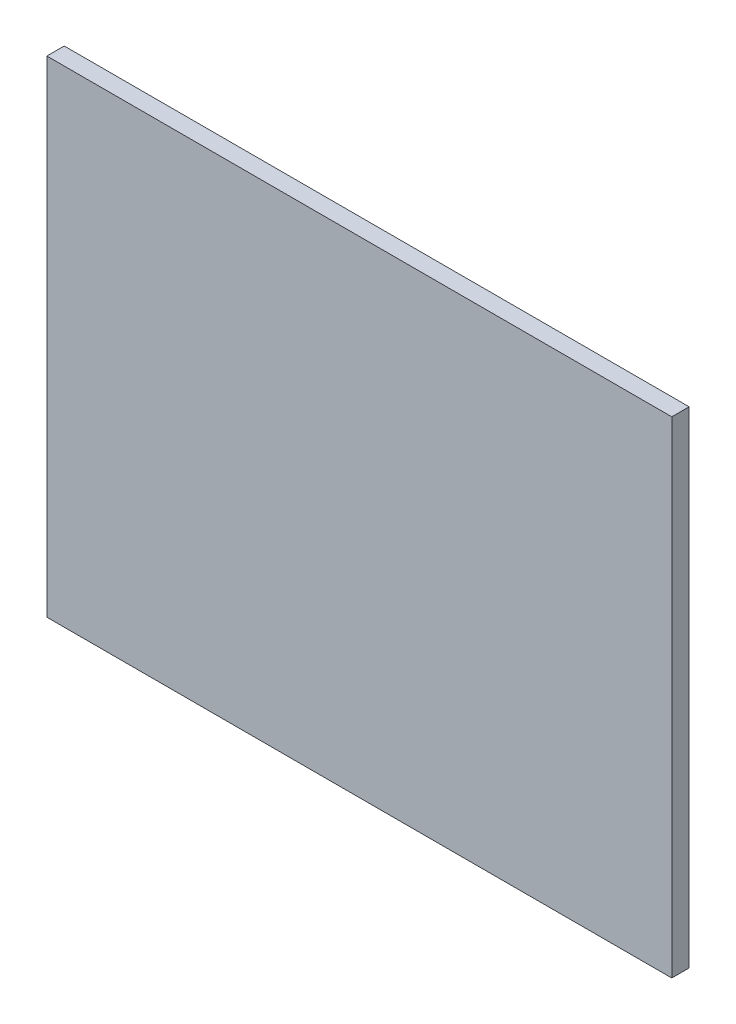
ISO-10303-21;
HEADER;
FILE_DESCRIPTION(('STEP AP214'),'2;1');
FILE_NAME('part.step','',(''),(''),'','','');
FILE_SCHEMA(('AUTOMOTIVE_DESIGN { 1 0 10303 214 1 1 1 1 }'));
ENDSEC;
DATA;
#1=APPLICATION_CONTEXT('core data for automotive mechanical design processes');
#2=APPLICATION_PROTOCOL_DEFINITION('international standard','automotive_design',2000,#1);
#3=PRODUCT_CONTEXT('',#1,'mechanical');
#4=PRODUCT('Part','Part','',(#3));
#5=PRODUCT_RELATED_PRODUCT_CATEGORY('part','',(#4));
#6=PRODUCT_DEFINITION_FORMATION('','',#4);
#7=PRODUCT_DEFINITION_CONTEXT('part definition',#1,'design');
#8=PRODUCT_DEFINITION('design','',#6,#7);
#9=PRODUCT_DEFINITION_SHAPE('','',#8);
#10=(LENGTH_UNIT() NAMED_UNIT(*) SI_UNIT(.MILLI.,.METRE.));
#11=(NAMED_UNIT(*) PLANE_ANGLE_UNIT() SI_UNIT($,.RADIAN.));
#12=(NAMED_UNIT(*) SI_UNIT($,.STERADIAN.) SOLID_ANGLE_UNIT());
#13=UNCERTAINTY_MEASURE_WITH_UNIT(LENGTH_MEASURE(1.E-05),#10,'distance_accuracy_value','');
#14=(GEOMETRIC_REPRESENTATION_CONTEXT(3) GLOBAL_UNCERTAINTY_ASSIGNED_CONTEXT((#13)) GLOBAL_UNIT_ASSIGNED_CONTEXT((#10,
#11,#12)) REPRESENTATION_CONTEXT('',''));
#15=CARTESIAN_POINT('',(0.,0.,0.));
#16=DIRECTION('',(0.,0.,1.));
#17=DIRECTION('',(1.,0.,0.));
#18=AXIS2_PLACEMENT_3D('',#15,#16,#17);
#19=CARTESIAN_POINT('',(-90.,70.,5.));
#20=DIRECTION('',(1.,0.,0.));
#21=DIRECTION('',(0.,1.,0.));
#22=AXIS2_PLACEMENT_3D('',#19,#20,#21);
#23=PLANE('',#22);
#24=DIRECTION('',(0.,-1.,0.));
#25=VECTOR('',#24,1.);
#26=CARTESIAN_POINT('',(-90.,70.,0.));
#27=LINE('',#26,#25);
#28=CARTESIAN_POINT('',(-90.,70.,0.));
#29=VERTEX_POINT('',#28);
#30=CARTESIAN_POINT('',(-90.,-70.,0.));
#31=VERTEX_POINT('',#30);
#32=EDGE_CURVE('E96',#29,#31,#27,.T.);
#33=ORIENTED_EDGE('',*,*,#32,.T.);
#34=DIRECTION('',(0.,0.,-1.));
#35=VECTOR('',#34,1.);
#36=CARTESIAN_POINT('',(-90.,-70.,5.));
#37=LINE('',#36,#35);
#38=CARTESIAN_POINT('',(-90.,-70.,5.));
#39=VERTEX_POINT('',#38);
#40=EDGE_CURVE('E11',#39,#31,#37,.T.);
#41=ORIENTED_EDGE('',*,*,#40,.F.);
#42=DIRECTION('',(0.,-1.,0.));
#43=VECTOR('',#42,1.);
#44=CARTESIAN_POINT('',(-90.,70.,5.));
#45=LINE('',#44,#43);
#46=CARTESIAN_POINT('',(-90.,70.,5.));
#47=VERTEX_POINT('',#46);
#48=EDGE_CURVE('E84',#47,#39,#45,.T.);
#49=ORIENTED_EDGE('',*,*,#48,.F.);
#50=DIRECTION('',(0.,0.,-1.));
#51=VECTOR('',#50,1.);
#52=CARTESIAN_POINT('',(-90.,70.,5.));
#53=LINE('',#52,#51);
#54=EDGE_CURVE('E92',#47,#29,#53,.T.);
#55=ORIENTED_EDGE('',*,*,#54,.T.);
#56=EDGE_LOOP('',(#33,#41,#49,#55));
#57=FACE_BOUND('',#56,.T.);
#58=ADVANCED_FACE('F33',(#57),#23,.F.);
#59=CARTESIAN_POINT('',(-90.,-70.,5.));
#60=DIRECTION('',(0.,1.,0.));
#61=DIRECTION('',(-1.,0.,0.));
#62=AXIS2_PLACEMENT_3D('',#59,#60,#61);
#63=PLANE('',#62);
#64=DIRECTION('',(1.,0.,0.));
#65=VECTOR('',#64,1.);
#66=CARTESIAN_POINT('',(-90.,-70.,0.));
#67=LINE('',#66,#65);
#68=CARTESIAN_POINT('',(90.,-70.,0.));
#69=VERTEX_POINT('',#68);
#70=EDGE_CURVE('E88',#31,#69,#67,.T.);
#71=ORIENTED_EDGE('',*,*,#70,.T.);
#72=DIRECTION('',(0.,0.,-1.));
#73=VECTOR('',#72,1.);
#74=CARTESIAN_POINT('',(90.,-70.,5.));
#75=LINE('',#74,#73);
#76=CARTESIAN_POINT('',(90.,-70.,5.));
#77=VERTEX_POINT('',#76);
#78=EDGE_CURVE('E41',#77,#69,#75,.T.);
#79=ORIENTED_EDGE('',*,*,#78,.F.);
#80=DIRECTION('',(1.,0.,0.));
#81=VECTOR('',#80,1.);
#82=CARTESIAN_POINT('',(-90.,-70.,5.));
#83=LINE('',#82,#81);
#84=EDGE_CURVE('E79',#39,#77,#83,.T.);
#85=ORIENTED_EDGE('',*,*,#84,.F.);
#86=ORIENTED_EDGE('',*,*,#40,.T.);
#87=EDGE_LOOP('',(#71,#79,#85,#86));
#88=FACE_BOUND('',#87,.T.);
#89=ADVANCED_FACE('F87',(#88),#63,.F.);
#90=CARTESIAN_POINT('',(90.,70.,5.));
#91=DIRECTION('',(-1.,0.,0.));
#92=DIRECTION('',(0.,-1.,0.));
#93=AXIS2_PLACEMENT_3D('',#90,#91,#92);
#94=PLANE('',#93);
#95=DIRECTION('',(0.,1.,0.));
#96=VECTOR('',#95,1.);
#97=CARTESIAN_POINT('',(90.,70.,0.));
#98=LINE('',#97,#96);
#99=CARTESIAN_POINT('',(90.,70.,0.));
#100=VERTEX_POINT('',#99);
#101=EDGE_CURVE('E66',#69,#100,#98,.T.);
#102=ORIENTED_EDGE('',*,*,#101,.T.);
#103=DIRECTION('',(0.,0.,-1.));
#104=VECTOR('',#103,1.);
#105=CARTESIAN_POINT('',(90.,70.,5.));
#106=LINE('',#105,#104);
#107=CARTESIAN_POINT('',(90.,70.,5.));
#108=VERTEX_POINT('',#107);
#109=EDGE_CURVE('E89',#108,#100,#106,.T.);
#110=ORIENTED_EDGE('',*,*,#109,.F.);
#111=DIRECTION('',(0.,1.,0.));
#112=VECTOR('',#111,1.);
#113=CARTESIAN_POINT('',(90.,70.,5.));
#114=LINE('',#113,#112);
#115=EDGE_CURVE('E82',#77,#108,#114,.T.);
#116=ORIENTED_EDGE('',*,*,#115,.F.);
#117=ORIENTED_EDGE('',*,*,#78,.T.);
#118=EDGE_LOOP('',(#102,#110,#116,#117));
#119=FACE_BOUND('',#118,.T.);
#120=ADVANCED_FACE('F90',(#119),#94,.F.);
#121=CARTESIAN_POINT('',(-90.,70.,5.));
#122=DIRECTION('',(0.,-1.,0.));
#123=DIRECTION('',(1.,0.,0.));
#124=AXIS2_PLACEMENT_3D('',#121,#122,#123);
#125=PLANE('',#124);
#126=DIRECTION('',(-1.,0.,0.));
#127=VECTOR('',#126,1.);
#128=CARTESIAN_POINT('',(-90.,70.,0.));
#129=LINE('',#128,#127);
#130=EDGE_CURVE('E72',#100,#29,#129,.T.);
#131=ORIENTED_EDGE('',*,*,#130,.T.);
#132=ORIENTED_EDGE('',*,*,#54,.F.);
#133=DIRECTION('',(-1.,0.,0.));
#134=VECTOR('',#133,1.);
#135=CARTESIAN_POINT('',(-90.,70.,5.));
#136=LINE('',#135,#134);
#137=EDGE_CURVE('E49',#108,#47,#136,.T.);
#138=ORIENTED_EDGE('',*,*,#137,.F.);
#139=ORIENTED_EDGE('',*,*,#109,.T.);
#140=EDGE_LOOP('',(#131,#132,#138,#139));
#141=FACE_BOUND('',#140,.T.);
#142=ADVANCED_FACE('F103',(#141),#125,.F.);
#143=CARTESIAN_POINT('',(0.,0.,5.));
#144=DIRECTION('',(0.,0.,1.));
#145=DIRECTION('',(1.,0.,0.));
#146=AXIS2_PLACEMENT_3D('',#143,#144,#145);
#147=PLANE('',#146);
#148=ORIENTED_EDGE('',*,*,#48,.T.);
#149=ORIENTED_EDGE('',*,*,#84,.T.);
#150=ORIENTED_EDGE('',*,*,#115,.T.);
#151=ORIENTED_EDGE('',*,*,#137,.T.);
#152=EDGE_LOOP('',(#148,#149,#150,#151));
#153=FACE_BOUND('',#152,.T.);
#154=ADVANCED_FACE('F80',(#153),#147,.T.);
#155=CARTESIAN_POINT('',(0.,0.,0.));
#156=DIRECTION('',(0.,0.,1.));
#157=DIRECTION('',(1.,0.,0.));
#158=AXIS2_PLACEMENT_3D('',#155,#156,#157);
#159=PLANE('',#158);
#160=ORIENTED_EDGE('',*,*,#32,.F.);
#161=ORIENTED_EDGE('',*,*,#130,.F.);
#162=ORIENTED_EDGE('',*,*,#101,.F.);
#163=ORIENTED_EDGE('',*,*,#70,.F.);
#164=EDGE_LOOP('',(#160,#161,#162,#163));
#165=FACE_BOUND('',#164,.T.);
#166=ADVANCED_FACE('F106',(#165),#159,.F.);
#167=CLOSED_SHELL('',(#58,#89,#120,#142,#154,#166));
#168=MANIFOLD_SOLID_BREP('B2',#167);
#169=ADVANCED_BREP_SHAPE_REPRESENTATION('',(#18,#168),#14);
#170=SHAPE_DEFINITION_REPRESENTATION(#9,#169);
ENDSEC;
END-ISO-10303-21;
